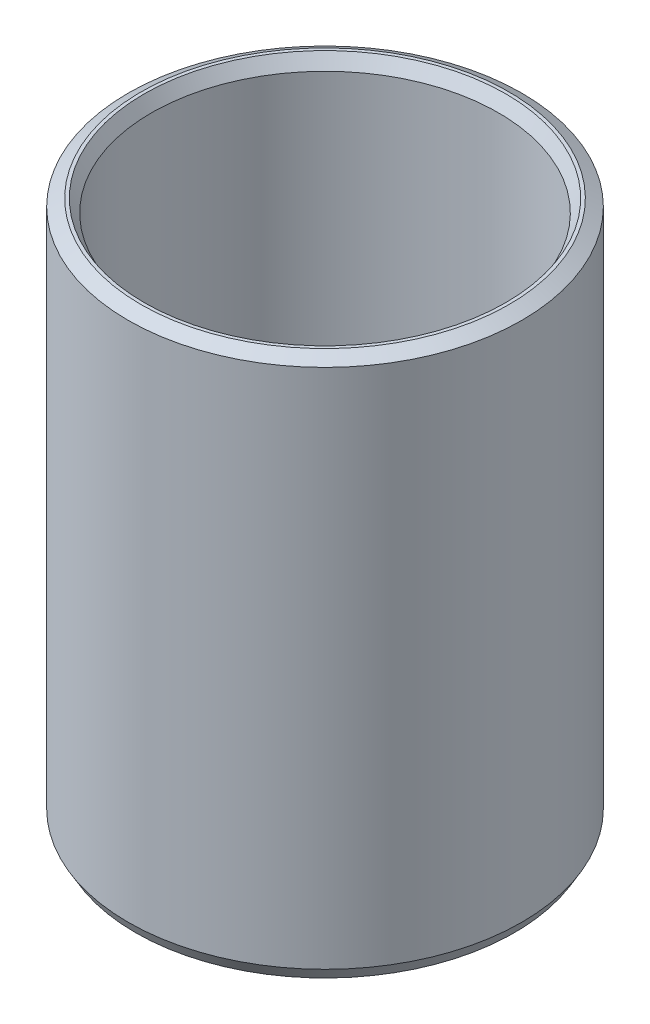
ISO-10303-21;
HEADER;
FILE_DESCRIPTION(('STEP AP214'),'2;1');
FILE_NAME('part.step','',(''),(''),'','','');
FILE_SCHEMA(('AUTOMOTIVE_DESIGN { 1 0 10303 214 1 1 1 1 }'));
ENDSEC;
DATA;
#1=APPLICATION_CONTEXT('core data for automotive mechanical design processes');
#2=APPLICATION_PROTOCOL_DEFINITION('international standard','automotive_design',2000,#1);
#3=PRODUCT_CONTEXT('',#1,'mechanical');
#4=PRODUCT('Part','Part','',(#3));
#5=PRODUCT_RELATED_PRODUCT_CATEGORY('part','',(#4));
#6=PRODUCT_DEFINITION_FORMATION('','',#4);
#7=PRODUCT_DEFINITION_CONTEXT('part definition',#1,'design');
#8=PRODUCT_DEFINITION('design','',#6,#7);
#9=PRODUCT_DEFINITION_SHAPE('','',#8);
#10=(LENGTH_UNIT() NAMED_UNIT(*) SI_UNIT(.MILLI.,.METRE.));
#11=(NAMED_UNIT(*) PLANE_ANGLE_UNIT() SI_UNIT($,.RADIAN.));
#12=(NAMED_UNIT(*) SI_UNIT($,.STERADIAN.) SOLID_ANGLE_UNIT());
#13=UNCERTAINTY_MEASURE_WITH_UNIT(LENGTH_MEASURE(1.E-05),#10,'distance_accuracy_value','');
#14=(GEOMETRIC_REPRESENTATION_CONTEXT(3) GLOBAL_UNCERTAINTY_ASSIGNED_CONTEXT((#13)) GLOBAL_UNIT_ASSIGNED_CONTEXT((#10,
#11,#12)) REPRESENTATION_CONTEXT('',''));
#15=CARTESIAN_POINT('',(0.,0.,0.));
#16=DIRECTION('',(0.,0.,1.));
#17=DIRECTION('',(1.,0.,0.));
#18=AXIS2_PLACEMENT_3D('',#15,#16,#17);
#19=CARTESIAN_POINT('',(0.,165.01827010719,0.));
#20=DIRECTION('',(0.,-1.,0.));
#21=DIRECTION('',(0.,0.,-1.));
#22=AXIS2_PLACEMENT_3D('',#19,#20,#21);
#23=CYLINDRICAL_SURFACE('',#22,60.);
#24=CARTESIAN_POINT('',(0.,3.87596307499452,0.));
#25=DIRECTION('',(0.,1.,0.));
#26=DIRECTION('',(0.,0.,1.));
#27=AXIS2_PLACEMENT_3D('',#24,#25,#26);
#28=CIRCLE('',#27,60.);
#29=CARTESIAN_POINT('',(0.,3.87596307499452,60.));
#30=VERTEX_POINT('',#29);
#31=EDGE_CURVE('E10',#30,#30,#28,.T.);
#32=ORIENTED_EDGE('',*,*,#31,.T.);
#33=EDGE_LOOP('',(#32));
#34=FACE_BOUND('',#33,.T.);
#35=CARTESIAN_POINT('',(0.,162.780481782473,0.));
#36=DIRECTION('',(0.,1.,0.));
#37=DIRECTION('',(0.,0.,1.));
#38=AXIS2_PLACEMENT_3D('',#35,#36,#37);
#39=CIRCLE('',#38,60.);
#40=CARTESIAN_POINT('',(0.,162.780481782473,60.));
#41=VERTEX_POINT('',#40);
#42=EDGE_CURVE('E50',#41,#41,#39,.F.);
#43=ORIENTED_EDGE('',*,*,#42,.T.);
#44=EDGE_LOOP('',(#43));
#45=FACE_BOUND('',#44,.T.);
#46=ADVANCED_FACE('F39',(#34,#45),#23,.T.);
#47=CARTESIAN_POINT('',(0.,165.01827010719,0.));
#48=DIRECTION('',(0.,1.,0.));
#49=DIRECTION('',(0.,0.,1.));
#50=AXIS2_PLACEMENT_3D('',#47,#48,#49);
#51=PLANE('',#50);
#52=CARTESIAN_POINT('',(0.,165.01827010719,0.));
#53=DIRECTION('',(0.,1.,0.));
#54=DIRECTION('',(0.,0.,1.));
#55=AXIS2_PLACEMENT_3D('',#52,#53,#54);
#56=CIRCLE('',#55,55.1245446164875);
#57=CARTESIAN_POINT('',(0.,165.01827010719,55.1245446164875));
#58=VERTEX_POINT('',#57);
#59=EDGE_CURVE('E58',#58,#58,#56,.F.);
#60=ORIENTED_EDGE('',*,*,#59,.T.);
#61=EDGE_LOOP('',(#60));
#62=FACE_BOUND('',#61,.T.);
#63=CARTESIAN_POINT('',(0.,165.01827010719,0.));
#64=DIRECTION('',(0.,1.,0.));
#65=DIRECTION('',(0.,0.,1.));
#66=AXIS2_PLACEMENT_3D('',#63,#64,#65);
#67=CIRCLE('',#66,56.1240369250054);
#68=CARTESIAN_POINT('',(0.,165.01827010719,56.1240369250054));
#69=VERTEX_POINT('',#68);
#70=EDGE_CURVE('E61',#69,#69,#67,.T.);
#71=ORIENTED_EDGE('',*,*,#70,.T.);
#72=EDGE_LOOP('',(#71));
#73=FACE_BOUND('',#72,.T.);
#74=ADVANCED_FACE('F88',(#62,#73),#51,.T.);
#75=CARTESIAN_POINT('',(0.,0.,0.));
#76=DIRECTION('',(0.,1.,0.));
#77=DIRECTION('',(0.,0.,1.));
#78=AXIS2_PLACEMENT_3D('',#75,#76,#77);
#79=PLANE('',#78);
#80=CARTESIAN_POINT('',(0.,0.,0.));
#81=DIRECTION('',(0.,1.,0.));
#82=DIRECTION('',(0.,0.,1.));
#83=AXIS2_PLACEMENT_3D('',#80,#81,#82);
#84=CIRCLE('',#83,56.7627193667649);
#85=CARTESIAN_POINT('',(0.,0.,56.7627193667649));
#86=VERTEX_POINT('',#85);
#87=EDGE_CURVE('E51',#86,#86,#84,.T.);
#88=ORIENTED_EDGE('',*,*,#87,.T.);
#89=EDGE_LOOP('',(#88));
#90=FACE_BOUND('',#89,.T.);
#91=CARTESIAN_POINT('',(0.,0.,0.));
#92=DIRECTION('',(0.,1.,0.));
#93=DIRECTION('',(0.,0.,1.));
#94=AXIS2_PLACEMENT_3D('',#91,#92,#93);
#95=CIRCLE('',#94,57.7622116752828);
#96=CARTESIAN_POINT('',(0.,0.,57.7622116752828));
#97=VERTEX_POINT('',#96);
#98=EDGE_CURVE('E54',#97,#97,#95,.F.);
#99=ORIENTED_EDGE('',*,*,#98,.T.);
#100=EDGE_LOOP('',(#99));
#101=FACE_BOUND('',#100,.T.);
#102=ADVANCED_FACE('F83',(#90,#101),#79,.F.);
#103=CARTESIAN_POINT('',(0.,165.01827010719,0.));
#104=DIRECTION('',(0.,-1.,0.));
#105=DIRECTION('',(0.,0.,-1.));
#106=AXIS2_PLACEMENT_3D('',#103,#104,#105);
#107=CYLINDRICAL_SURFACE('',#106,52.8867562917703);
#108=CARTESIAN_POINT('',(0.,161.142307032196,0.));
#109=DIRECTION('',(0.,1.,0.));
#110=DIRECTION('',(0.,0.,1.));
#111=AXIS2_PLACEMENT_3D('',#108,#109,#110);
#112=CIRCLE('',#111,52.8867562917703);
#113=CARTESIAN_POINT('',(0.,161.142307032196,52.8867562917703));
#114=VERTEX_POINT('',#113);
#115=EDGE_CURVE('E67',#114,#114,#112,.T.);
#116=ORIENTED_EDGE('',*,*,#115,.T.);
#117=EDGE_LOOP('',(#116));
#118=FACE_BOUND('',#117,.T.);
#119=CARTESIAN_POINT('',(0.,2.23778832471719,0.));
#120=DIRECTION('',(0.,1.,0.));
#121=DIRECTION('',(0.,0.,1.));
#122=AXIS2_PLACEMENT_3D('',#119,#120,#121);
#123=CIRCLE('',#122,52.8867562917703);
#124=CARTESIAN_POINT('',(0.,2.23778832471719,52.8867562917703));
#125=VERTEX_POINT('',#124);
#126=EDGE_CURVE('E69',#125,#125,#123,.F.);
#127=ORIENTED_EDGE('',*,*,#126,.T.);
#128=EDGE_LOOP('',(#127));
#129=FACE_BOUND('',#128,.T.);
#130=ADVANCED_FACE('F71',(#118,#129),#107,.F.);
#131=CARTESIAN_POINT('',(0.,161.142307032196,0.));
#132=DIRECTION('',(0.,1.,0.));
#133=DIRECTION('',(0.,0.,1.));
#134=AXIS2_PLACEMENT_3D('',#131,#132,#133);
#135=CONICAL_SURFACE('',#134,52.8867562917703,0.523598775598294);
#136=ORIENTED_EDGE('',*,*,#59,.F.);
#137=EDGE_LOOP('',(#136));
#138=FACE_BOUND('',#137,.T.);
#139=ORIENTED_EDGE('',*,*,#115,.F.);
#140=EDGE_LOOP('',(#139));
#141=FACE_BOUND('',#140,.T.);
#142=ADVANCED_FACE('F77',(#138,#141),#135,.F.);
#143=CARTESIAN_POINT('',(0.,0.,0.));
#144=DIRECTION('',(0.,-1.,0.));
#145=DIRECTION('',(0.,0.,-1.));
#146=AXIS2_PLACEMENT_3D('',#143,#144,#145);
#147=CONICAL_SURFACE('',#146,56.7627193667649,1.04719755119659);
#148=ORIENTED_EDGE('',*,*,#126,.F.);
#149=EDGE_LOOP('',(#148));
#150=FACE_BOUND('',#149,.T.);
#151=ORIENTED_EDGE('',*,*,#87,.F.);
#152=EDGE_LOOP('',(#151));
#153=FACE_BOUND('',#152,.T.);
#154=ADVANCED_FACE('F73',(#150,#153),#147,.F.);
#155=CARTESIAN_POINT('',(0.,3.87596307499452,0.));
#156=DIRECTION('',(0.,1.,0.));
#157=DIRECTION('',(0.,0.,1.));
#158=AXIS2_PLACEMENT_3D('',#155,#156,#157);
#159=CONICAL_SURFACE('',#158,60.,0.523598775598302);
#160=ORIENTED_EDGE('',*,*,#98,.F.);
#161=EDGE_LOOP('',(#160));
#162=FACE_BOUND('',#161,.T.);
#163=ORIENTED_EDGE('',*,*,#31,.F.);
#164=EDGE_LOOP('',(#163));
#165=FACE_BOUND('',#164,.T.);
#166=ADVANCED_FACE('F76',(#162,#165),#159,.T.);
#167=CARTESIAN_POINT('',(0.,165.01827010719,0.));
#168=DIRECTION('',(0.,-1.,0.));
#169=DIRECTION('',(0.,0.,-1.));
#170=AXIS2_PLACEMENT_3D('',#167,#168,#169);
#171=CONICAL_SURFACE('',#170,56.1240369250054,1.0471975511966);
#172=ORIENTED_EDGE('',*,*,#42,.F.);
#173=EDGE_LOOP('',(#172));
#174=FACE_BOUND('',#173,.T.);
#175=ORIENTED_EDGE('',*,*,#70,.F.);
#176=EDGE_LOOP('',(#175));
#177=FACE_BOUND('',#176,.T.);
#178=ADVANCED_FACE('F45',(#174,#177),#171,.T.);
#179=CLOSED_SHELL('',(#46,#74,#102,#130,#142,#154,#166,#178));
#180=MANIFOLD_SOLID_BREP('B2',#179);
#181=ADVANCED_BREP_SHAPE_REPRESENTATION('',(#18,#180),#14);
#182=SHAPE_DEFINITION_REPRESENTATION(#9,#181);
ENDSEC;
END-ISO-10303-21;
